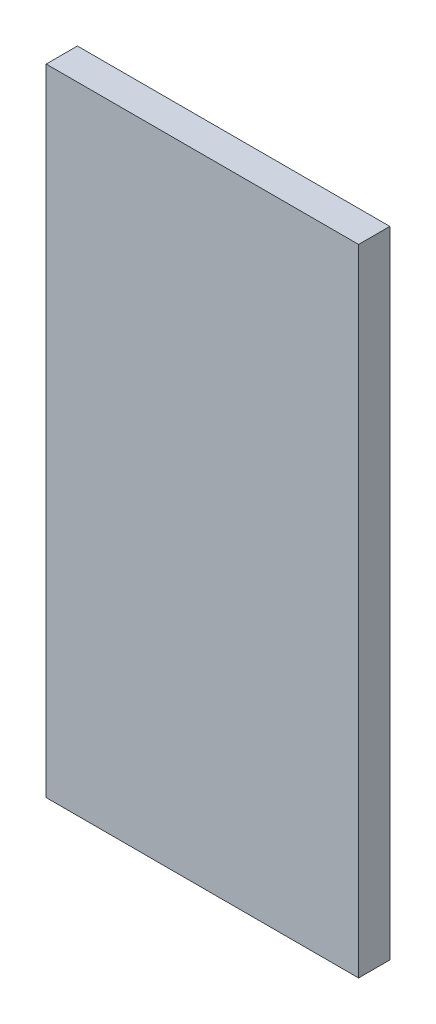
ISO-10303-21;
HEADER;
FILE_DESCRIPTION(('STEP AP214'),'2;1');
FILE_NAME('part.step','',(''),(''),'','','');
FILE_SCHEMA(('AUTOMOTIVE_DESIGN { 1 0 10303 214 1 1 1 1 }'));
ENDSEC;
DATA;
#1=APPLICATION_CONTEXT('core data for automotive mechanical design processes');
#2=APPLICATION_PROTOCOL_DEFINITION('international standard','automotive_design',2000,#1);
#3=PRODUCT_CONTEXT('',#1,'mechanical');
#4=PRODUCT('Part','Part','',(#3));
#5=PRODUCT_RELATED_PRODUCT_CATEGORY('part','',(#4));
#6=PRODUCT_DEFINITION_FORMATION('','',#4);
#7=PRODUCT_DEFINITION_CONTEXT('part definition',#1,'design');
#8=PRODUCT_DEFINITION('design','',#6,#7);
#9=PRODUCT_DEFINITION_SHAPE('','',#8);
#10=(LENGTH_UNIT() NAMED_UNIT(*) SI_UNIT(.MILLI.,.METRE.));
#11=(NAMED_UNIT(*) PLANE_ANGLE_UNIT() SI_UNIT($,.RADIAN.));
#12=(NAMED_UNIT(*) SI_UNIT($,.STERADIAN.) SOLID_ANGLE_UNIT());
#13=UNCERTAINTY_MEASURE_WITH_UNIT(LENGTH_MEASURE(1.E-05),#10,'distance_accuracy_value','');
#14=(GEOMETRIC_REPRESENTATION_CONTEXT(3) GLOBAL_UNCERTAINTY_ASSIGNED_CONTEXT((#13)) GLOBAL_UNIT_ASSIGNED_CONTEXT((#10,
#11,#12)) REPRESENTATION_CONTEXT('',''));
#15=CARTESIAN_POINT('',(0.,0.,0.));
#16=DIRECTION('',(0.,0.,1.));
#17=DIRECTION('',(1.,0.,0.));
#18=AXIS2_PLACEMENT_3D('',#15,#16,#17);
#19=CARTESIAN_POINT('',(-125.350427845632,43.9908438206065,3.));
#20=DIRECTION('',(0.,1.,0.));
#21=DIRECTION('',(0.,0.,1.));
#22=AXIS2_PLACEMENT_3D('',#19,#20,#21);
#23=PLANE('',#22);
#24=DIRECTION('',(1.,0.,0.));
#25=VECTOR('',#24,1.);
#26=CARTESIAN_POINT('',(-125.350427845632,43.9908438206065,0.));
#27=LINE('',#26,#25);
#28=CARTESIAN_POINT('',(-125.350427845632,43.9908438206065,0.));
#29=VERTEX_POINT('',#28);
#30=CARTESIAN_POINT('',(-95.3504278456318,43.9908438206065,0.));
#31=VERTEX_POINT('',#30);
#32=EDGE_CURVE('E95',#29,#31,#27,.T.);
#33=ORIENTED_EDGE('',*,*,#32,.T.);
#34=DIRECTION('',(0.,0.,-1.));
#35=VECTOR('',#34,1.);
#36=CARTESIAN_POINT('',(-95.3504278456318,43.9908438206065,3.));
#37=LINE('',#36,#35);
#38=CARTESIAN_POINT('',(-95.3504278456318,43.9908438206065,3.));
#39=VERTEX_POINT('',#38);
#40=EDGE_CURVE('E11',#39,#31,#37,.T.);
#41=ORIENTED_EDGE('',*,*,#40,.F.);
#42=DIRECTION('',(1.,0.,0.));
#43=VECTOR('',#42,1.);
#44=CARTESIAN_POINT('',(-125.350427845632,43.9908438206065,3.));
#45=LINE('',#44,#43);
#46=CARTESIAN_POINT('',(-125.350427845632,43.9908438206065,3.));
#47=VERTEX_POINT('',#46);
#48=EDGE_CURVE('E83',#47,#39,#45,.T.);
#49=ORIENTED_EDGE('',*,*,#48,.F.);
#50=DIRECTION('',(0.,0.,-1.));
#51=VECTOR('',#50,1.);
#52=CARTESIAN_POINT('',(-125.350427845632,43.9908438206065,3.));
#53=LINE('',#52,#51);
#54=EDGE_CURVE('E91',#47,#29,#53,.T.);
#55=ORIENTED_EDGE('',*,*,#54,.T.);
#56=EDGE_LOOP('',(#33,#41,#49,#55));
#57=FACE_BOUND('',#56,.T.);
#58=ADVANCED_FACE('F32',(#57),#23,.F.);
#59=CARTESIAN_POINT('',(-95.3504278456318,43.9908438206065,3.));
#60=DIRECTION('',(-1.,0.,0.));
#61=DIRECTION('',(0.,-1.,0.));
#62=AXIS2_PLACEMENT_3D('',#59,#60,#61);
#63=PLANE('',#62);
#64=DIRECTION('',(0.,1.,0.));
#65=VECTOR('',#64,1.);
#66=CARTESIAN_POINT('',(-95.3504278456318,43.9908438206065,0.));
#67=LINE('',#66,#65);
#68=CARTESIAN_POINT('',(-95.3504278456318,104.990843820607,0.));
#69=VERTEX_POINT('',#68);
#70=EDGE_CURVE('E87',#31,#69,#67,.T.);
#71=ORIENTED_EDGE('',*,*,#70,.T.);
#72=DIRECTION('',(0.,0.,-1.));
#73=VECTOR('',#72,1.);
#74=CARTESIAN_POINT('',(-95.3504278456318,104.990843820607,3.));
#75=LINE('',#74,#73);
#76=CARTESIAN_POINT('',(-95.3504278456318,104.990843820607,3.));
#77=VERTEX_POINT('',#76);
#78=EDGE_CURVE('E40',#77,#69,#75,.T.);
#79=ORIENTED_EDGE('',*,*,#78,.F.);
#80=DIRECTION('',(0.,1.,0.));
#81=VECTOR('',#80,1.);
#82=CARTESIAN_POINT('',(-95.3504278456318,43.9908438206065,3.));
#83=LINE('',#82,#81);
#84=EDGE_CURVE('E78',#39,#77,#83,.T.);
#85=ORIENTED_EDGE('',*,*,#84,.F.);
#86=ORIENTED_EDGE('',*,*,#40,.T.);
#87=EDGE_LOOP('',(#71,#79,#85,#86));
#88=FACE_BOUND('',#87,.T.);
#89=ADVANCED_FACE('F86',(#88),#63,.F.);
#90=CARTESIAN_POINT('',(-95.3504278456318,104.990843820607,3.));
#91=DIRECTION('',(0.,-1.,0.));
#92=DIRECTION('',(1.,0.,0.));
#93=AXIS2_PLACEMENT_3D('',#90,#91,#92);
#94=PLANE('',#93);
#95=DIRECTION('',(-1.,0.,0.));
#96=VECTOR('',#95,1.);
#97=CARTESIAN_POINT('',(-95.3504278456318,104.990843820607,0.));
#98=LINE('',#97,#96);
#99=CARTESIAN_POINT('',(-125.350427845632,104.990843820607,0.));
#100=VERTEX_POINT('',#99);
#101=EDGE_CURVE('E65',#69,#100,#98,.T.);
#102=ORIENTED_EDGE('',*,*,#101,.T.);
#103=DIRECTION('',(0.,0.,-1.));
#104=VECTOR('',#103,1.);
#105=CARTESIAN_POINT('',(-125.350427845632,104.990843820607,3.));
#106=LINE('',#105,#104);
#107=CARTESIAN_POINT('',(-125.350427845632,104.990843820607,3.));
#108=VERTEX_POINT('',#107);
#109=EDGE_CURVE('E88',#108,#100,#106,.T.);
#110=ORIENTED_EDGE('',*,*,#109,.F.);
#111=DIRECTION('',(-1.,0.,0.));
#112=VECTOR('',#111,1.);
#113=CARTESIAN_POINT('',(-95.3504278456318,104.990843820607,3.));
#114=LINE('',#113,#112);
#115=EDGE_CURVE('E81',#77,#108,#114,.T.);
#116=ORIENTED_EDGE('',*,*,#115,.F.);
#117=ORIENTED_EDGE('',*,*,#78,.T.);
#118=EDGE_LOOP('',(#102,#110,#116,#117));
#119=FACE_BOUND('',#118,.T.);
#120=ADVANCED_FACE('F89',(#119),#94,.F.);
#121=CARTESIAN_POINT('',(-125.350427845632,104.990843820607,3.));
#122=DIRECTION('',(1.,0.,0.));
#123=DIRECTION('',(0.,0.,-1.));
#124=AXIS2_PLACEMENT_3D('',#121,#122,#123);
#125=PLANE('',#124);
#126=DIRECTION('',(0.,-1.,0.));
#127=VECTOR('',#126,1.);
#128=CARTESIAN_POINT('',(-125.350427845632,104.990843820607,0.));
#129=LINE('',#128,#127);
#130=EDGE_CURVE('E71',#100,#29,#129,.T.);
#131=ORIENTED_EDGE('',*,*,#130,.T.);
#132=ORIENTED_EDGE('',*,*,#54,.F.);
#133=DIRECTION('',(0.,-1.,0.));
#134=VECTOR('',#133,1.);
#135=CARTESIAN_POINT('',(-125.350427845632,104.990843820607,3.));
#136=LINE('',#135,#134);
#137=EDGE_CURVE('E48',#108,#47,#136,.T.);
#138=ORIENTED_EDGE('',*,*,#137,.F.);
#139=ORIENTED_EDGE('',*,*,#109,.T.);
#140=EDGE_LOOP('',(#131,#132,#138,#139));
#141=FACE_BOUND('',#140,.T.);
#142=ADVANCED_FACE('F102',(#141),#125,.F.);
#143=CARTESIAN_POINT('',(0.,0.,3.));
#144=DIRECTION('',(0.,0.,1.));
#145=DIRECTION('',(1.,0.,0.));
#146=AXIS2_PLACEMENT_3D('',#143,#144,#145);
#147=PLANE('',#146);
#148=ORIENTED_EDGE('',*,*,#48,.T.);
#149=ORIENTED_EDGE('',*,*,#84,.T.);
#150=ORIENTED_EDGE('',*,*,#115,.T.);
#151=ORIENTED_EDGE('',*,*,#137,.T.);
#152=EDGE_LOOP('',(#148,#149,#150,#151));
#153=FACE_BOUND('',#152,.T.);
#154=ADVANCED_FACE('F79',(#153),#147,.T.);
#155=CARTESIAN_POINT('',(0.,0.,0.));
#156=DIRECTION('',(0.,0.,1.));
#157=DIRECTION('',(1.,0.,0.));
#158=AXIS2_PLACEMENT_3D('',#155,#156,#157);
#159=PLANE('',#158);
#160=ORIENTED_EDGE('',*,*,#32,.F.);
#161=ORIENTED_EDGE('',*,*,#130,.F.);
#162=ORIENTED_EDGE('',*,*,#101,.F.);
#163=ORIENTED_EDGE('',*,*,#70,.F.);
#164=EDGE_LOOP('',(#160,#161,#162,#163));
#165=FACE_BOUND('',#164,.T.);
#166=ADVANCED_FACE('F105',(#165),#159,.F.);
#167=CLOSED_SHELL('',(#58,#89,#120,#142,#154,#166));
#168=MANIFOLD_SOLID_BREP('B2',#167);
#169=ADVANCED_BREP_SHAPE_REPRESENTATION('',(#18,#168),#14);
#170=SHAPE_DEFINITION_REPRESENTATION(#9,#169);
ENDSEC;
END-ISO-10303-21;
